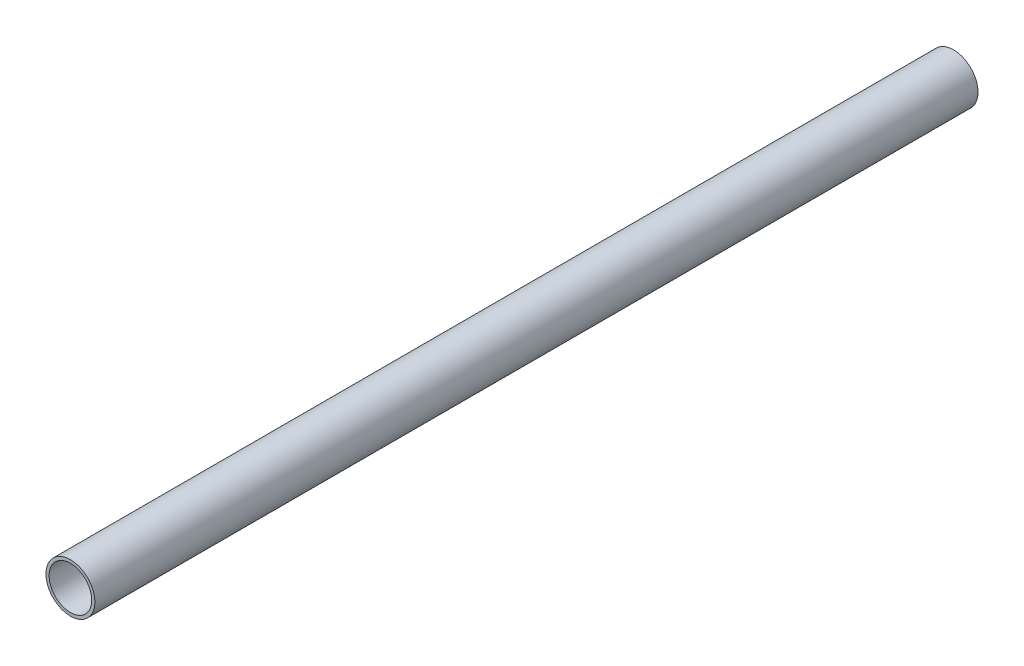
ISO-10303-21;
HEADER;
FILE_DESCRIPTION(('STEP AP214'),'2;1');
FILE_NAME('part.step','',(''),(''),'','','');
FILE_SCHEMA(('AUTOMOTIVE_DESIGN { 1 0 10303 214 1 1 1 1 }'));
ENDSEC;
DATA;
#1=APPLICATION_CONTEXT('core data for automotive mechanical design processes');
#2=APPLICATION_PROTOCOL_DEFINITION('international standard','automotive_design',2000,#1);
#3=PRODUCT_CONTEXT('',#1,'mechanical');
#4=PRODUCT('Part','Part','',(#3));
#5=PRODUCT_RELATED_PRODUCT_CATEGORY('part','',(#4));
#6=PRODUCT_DEFINITION_FORMATION('','',#4);
#7=PRODUCT_DEFINITION_CONTEXT('part definition',#1,'design');
#8=PRODUCT_DEFINITION('design','',#6,#7);
#9=PRODUCT_DEFINITION_SHAPE('','',#8);
#10=(LENGTH_UNIT() NAMED_UNIT(*) SI_UNIT(.MILLI.,.METRE.));
#11=(NAMED_UNIT(*) PLANE_ANGLE_UNIT() SI_UNIT($,.RADIAN.));
#12=(NAMED_UNIT(*) SI_UNIT($,.STERADIAN.) SOLID_ANGLE_UNIT());
#13=UNCERTAINTY_MEASURE_WITH_UNIT(LENGTH_MEASURE(1.E-05),#10,'distance_accuracy_value','');
#14=(GEOMETRIC_REPRESENTATION_CONTEXT(3) GLOBAL_UNCERTAINTY_ASSIGNED_CONTEXT((#13)) GLOBAL_UNIT_ASSIGNED_CONTEXT((#10,
#11,#12)) REPRESENTATION_CONTEXT('',''));
#15=CARTESIAN_POINT('',(0.,0.,0.));
#16=DIRECTION('',(0.,0.,1.));
#17=DIRECTION('',(1.,0.,0.));
#18=AXIS2_PLACEMENT_3D('',#15,#16,#17);
#19=CARTESIAN_POINT('',(-143.,40.45,284.7));
#20=DIRECTION('',(0.,0.,-1.));
#21=DIRECTION('',(-1.,0.,0.));
#22=AXIS2_PLACEMENT_3D('',#19,#20,#21);
#23=CYLINDRICAL_SURFACE('',#22,7.75);
#24=CARTESIAN_POINT('',(-143.,40.45,284.7));
#25=DIRECTION('',(0.,0.,1.));
#26=DIRECTION('',(1.,0.,0.));
#27=AXIS2_PLACEMENT_3D('',#24,#25,#26);
#28=CIRCLE('',#27,7.75);
#29=CARTESIAN_POINT('',(-135.25,40.45,284.7));
#30=VERTEX_POINT('',#29);
#31=EDGE_CURVE('E10',#30,#30,#28,.T.);
#32=ORIENTED_EDGE('',*,*,#31,.F.);
#33=EDGE_LOOP('',(#32));
#34=FACE_BOUND('',#33,.T.);
#35=CARTESIAN_POINT('',(-143.,40.45,5.));
#36=DIRECTION('',(0.,0.,1.));
#37=DIRECTION('',(1.,0.,0.));
#38=AXIS2_PLACEMENT_3D('',#35,#36,#37);
#39=CIRCLE('',#38,7.75);
#40=CARTESIAN_POINT('',(-135.25,40.45,5.));
#41=VERTEX_POINT('',#40);
#42=EDGE_CURVE('E38',#41,#41,#39,.T.);
#43=ORIENTED_EDGE('',*,*,#42,.T.);
#44=EDGE_LOOP('',(#43));
#45=FACE_BOUND('',#44,.T.);
#46=ADVANCED_FACE('F31',(#34,#45),#23,.T.);
#47=CARTESIAN_POINT('',(-143.,40.45,284.7));
#48=DIRECTION('',(0.,0.,1.));
#49=DIRECTION('',(1.,0.,0.));
#50=AXIS2_PLACEMENT_3D('',#47,#48,#49);
#51=PLANE('',#50);
#52=CARTESIAN_POINT('',(-143.,40.45,284.7));
#53=DIRECTION('',(0.,0.,1.));
#54=DIRECTION('',(1.,0.,0.));
#55=AXIS2_PLACEMENT_3D('',#52,#53,#54);
#56=CIRCLE('',#55,6.75000000000001);
#57=CARTESIAN_POINT('',(-136.25,40.45,284.7));
#58=VERTEX_POINT('',#57);
#59=EDGE_CURVE('E44',#58,#58,#56,.T.);
#60=ORIENTED_EDGE('',*,*,#59,.F.);
#61=EDGE_LOOP('',(#60));
#62=FACE_BOUND('',#61,.T.);
#63=ORIENTED_EDGE('',*,*,#31,.T.);
#64=EDGE_LOOP('',(#63));
#65=FACE_BOUND('',#64,.T.);
#66=ADVANCED_FACE('F60',(#62,#65),#51,.T.);
#67=CARTESIAN_POINT('',(-143.,40.45,5.));
#68=DIRECTION('',(0.,0.,1.));
#69=DIRECTION('',(1.,0.,0.));
#70=AXIS2_PLACEMENT_3D('',#67,#68,#69);
#71=PLANE('',#70);
#72=CARTESIAN_POINT('',(-143.,40.45,5.));
#73=DIRECTION('',(0.,0.,1.));
#74=DIRECTION('',(1.,0.,0.));
#75=AXIS2_PLACEMENT_3D('',#72,#73,#74);
#76=CIRCLE('',#75,6.75000000000001);
#77=CARTESIAN_POINT('',(-136.25,40.45,5.));
#78=VERTEX_POINT('',#77);
#79=EDGE_CURVE('E34',#78,#78,#76,.T.);
#80=ORIENTED_EDGE('',*,*,#79,.T.);
#81=EDGE_LOOP('',(#80));
#82=FACE_BOUND('',#81,.T.);
#83=ORIENTED_EDGE('',*,*,#42,.F.);
#84=EDGE_LOOP('',(#83));
#85=FACE_BOUND('',#84,.T.);
#86=ADVANCED_FACE('F51',(#82,#85),#71,.F.);
#87=CARTESIAN_POINT('',(-143.,40.45,-284.7));
#88=DIRECTION('',(0.,0.,1.));
#89=DIRECTION('',(1.,0.,0.));
#90=AXIS2_PLACEMENT_3D('',#87,#88,#89);
#91=CYLINDRICAL_SURFACE('',#90,6.75000000000001);
#92=ORIENTED_EDGE('',*,*,#59,.T.);
#93=EDGE_LOOP('',(#92));
#94=FACE_BOUND('',#93,.T.);
#95=ORIENTED_EDGE('',*,*,#79,.F.);
#96=EDGE_LOOP('',(#95));
#97=FACE_BOUND('',#96,.T.);
#98=ADVANCED_FACE('F54',(#94,#97),#91,.F.);
#99=CLOSED_SHELL('',(#46,#66,#86,#98));
#100=MANIFOLD_SOLID_BREP('B2',#99);
#101=ADVANCED_BREP_SHAPE_REPRESENTATION('',(#18,#100),#14);
#102=SHAPE_DEFINITION_REPRESENTATION(#9,#101);
ENDSEC;
END-ISO-10303-21;
